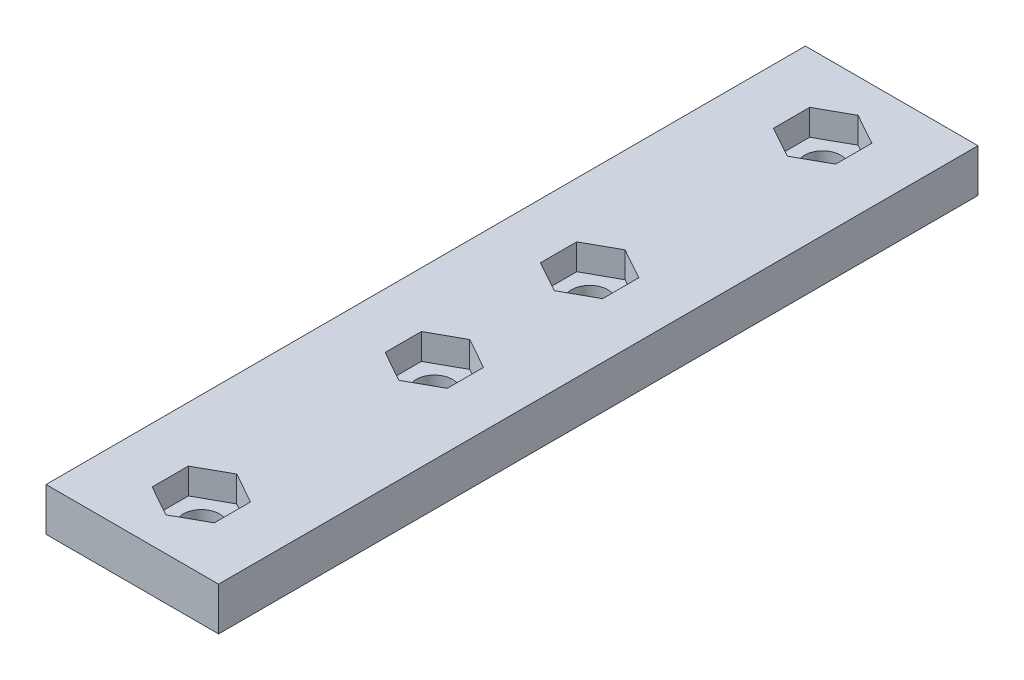
ISO-10303-21;
HEADER;
FILE_DESCRIPTION(('STEP AP214'),'2;1');
FILE_NAME('part.step','',(''),(''),'','','');
FILE_SCHEMA(('AUTOMOTIVE_DESIGN { 1 0 10303 214 1 1 1 1 }'));
ENDSEC;
DATA;
#1=APPLICATION_CONTEXT('core data for automotive mechanical design processes');
#2=APPLICATION_PROTOCOL_DEFINITION('international standard','automotive_design',2000,#1);
#3=PRODUCT_CONTEXT('',#1,'mechanical');
#4=PRODUCT('Part','Part','',(#3));
#5=PRODUCT_RELATED_PRODUCT_CATEGORY('part','',(#4));
#6=PRODUCT_DEFINITION_FORMATION('','',#4);
#7=PRODUCT_DEFINITION_CONTEXT('part definition',#1,'design');
#8=PRODUCT_DEFINITION('design','',#6,#7);
#9=PRODUCT_DEFINITION_SHAPE('','',#8);
#10=(LENGTH_UNIT() NAMED_UNIT(*) SI_UNIT(.MILLI.,.METRE.));
#11=(NAMED_UNIT(*) PLANE_ANGLE_UNIT() SI_UNIT($,.RADIAN.));
#12=(NAMED_UNIT(*) SI_UNIT($,.STERADIAN.) SOLID_ANGLE_UNIT());
#13=UNCERTAINTY_MEASURE_WITH_UNIT(LENGTH_MEASURE(1.E-05),#10,'distance_accuracy_value','');
#14=(GEOMETRIC_REPRESENTATION_CONTEXT(3) GLOBAL_UNCERTAINTY_ASSIGNED_CONTEXT((#13)) GLOBAL_UNIT_ASSIGNED_CONTEXT((#10,
#11,#12)) REPRESENTATION_CONTEXT('',''));
#15=CARTESIAN_POINT('',(0.,0.,0.));
#16=DIRECTION('',(0.,0.,1.));
#17=DIRECTION('',(1.,0.,0.));
#18=AXIS2_PLACEMENT_3D('',#15,#16,#17);
#19=CARTESIAN_POINT('',(0.,5.,31.5));
#20=DIRECTION('',(0.,-1.,0.));
#21=DIRECTION('',(0.,0.,-1.));
#22=AXIS2_PLACEMENT_3D('',#19,#20,#21);
#23=CYLINDRICAL_SURFACE('',#22,2.1);
#24=CARTESIAN_POINT('',(0.,0.,31.5));
#25=DIRECTION('',(0.,1.,0.));
#26=DIRECTION('',(0.,0.,1.));
#27=AXIS2_PLACEMENT_3D('',#24,#25,#26);
#28=CIRCLE('',#27,2.1);
#29=CARTESIAN_POINT('',(0.,0.,33.6));
#30=VERTEX_POINT('',#29);
#31=EDGE_CURVE('E544',#30,#30,#28,.F.);
#32=ORIENTED_EDGE('',*,*,#31,.T.);
#33=EDGE_LOOP('',(#32));
#34=FACE_BOUND('',#33,.T.);
#35=CARTESIAN_POINT('',(0.,2.,31.5));
#36=DIRECTION('',(0.,1.,0.));
#37=DIRECTION('',(0.,0.,1.));
#38=AXIS2_PLACEMENT_3D('',#35,#36,#37);
#39=CIRCLE('',#38,2.1);
#40=CARTESIAN_POINT('',(0.,2.,33.6));
#41=VERTEX_POINT('',#40);
#42=EDGE_CURVE('E391',#41,#41,#39,.F.);
#43=ORIENTED_EDGE('',*,*,#42,.F.);
#44=EDGE_LOOP('',(#43));
#45=FACE_BOUND('',#44,.T.);
#46=ADVANCED_FACE('F41',(#34,#45),#23,.F.);
#47=CARTESIAN_POINT('',(0.,5.,-13.5));
#48=DIRECTION('',(0.,-1.,0.));
#49=DIRECTION('',(0.,0.,-1.));
#50=AXIS2_PLACEMENT_3D('',#47,#48,#49);
#51=CYLINDRICAL_SURFACE('',#50,2.1);
#52=CARTESIAN_POINT('',(0.,0.,-13.5));
#53=DIRECTION('',(0.,1.,0.));
#54=DIRECTION('',(0.,0.,1.));
#55=AXIS2_PLACEMENT_3D('',#52,#53,#54);
#56=CIRCLE('',#55,2.1);
#57=CARTESIAN_POINT('',(0.,0.,-11.4));
#58=VERTEX_POINT('',#57);
#59=EDGE_CURVE('E524',#58,#58,#56,.T.);
#60=ORIENTED_EDGE('',*,*,#59,.F.);
#61=EDGE_LOOP('',(#60));
#62=FACE_BOUND('',#61,.T.);
#63=CARTESIAN_POINT('',(0.,2.,-13.5));
#64=DIRECTION('',(0.,1.,0.));
#65=DIRECTION('',(0.,0.,1.));
#66=AXIS2_PLACEMENT_3D('',#63,#64,#65);
#67=CIRCLE('',#66,2.1);
#68=CARTESIAN_POINT('',(0.,2.,-11.4));
#69=VERTEX_POINT('',#68);
#70=EDGE_CURVE('E234',#69,#69,#67,.F.);
#71=ORIENTED_EDGE('',*,*,#70,.F.);
#72=EDGE_LOOP('',(#71));
#73=FACE_BOUND('',#72,.T.);
#74=ADVANCED_FACE('F621',(#62,#73),#51,.F.);
#75=CARTESIAN_POINT('',(0.,5.,13.5));
#76=DIRECTION('',(0.,-1.,0.));
#77=DIRECTION('',(0.,0.,-1.));
#78=AXIS2_PLACEMENT_3D('',#75,#76,#77);
#79=CYLINDRICAL_SURFACE('',#78,2.1);
#80=CARTESIAN_POINT('',(0.,0.,13.5));
#81=DIRECTION('',(0.,1.,0.));
#82=DIRECTION('',(0.,0.,1.));
#83=AXIS2_PLACEMENT_3D('',#80,#81,#82);
#84=CIRCLE('',#83,2.1);
#85=CARTESIAN_POINT('',(0.,0.,15.6));
#86=VERTEX_POINT('',#85);
#87=EDGE_CURVE('E292',#86,#86,#84,.T.);
#88=ORIENTED_EDGE('',*,*,#87,.F.);
#89=EDGE_LOOP('',(#88));
#90=FACE_BOUND('',#89,.T.);
#91=CARTESIAN_POINT('',(0.,2.,13.5));
#92=DIRECTION('',(0.,1.,0.));
#93=DIRECTION('',(0.,0.,1.));
#94=AXIS2_PLACEMENT_3D('',#91,#92,#93);
#95=CIRCLE('',#94,2.1);
#96=CARTESIAN_POINT('',(0.,2.,15.6));
#97=VERTEX_POINT('',#96);
#98=EDGE_CURVE('E326',#97,#97,#95,.F.);
#99=ORIENTED_EDGE('',*,*,#98,.F.);
#100=EDGE_LOOP('',(#99));
#101=FACE_BOUND('',#100,.T.);
#102=ADVANCED_FACE('F43',(#90,#101),#79,.F.);
#103=CARTESIAN_POINT('',(0.,5.,58.5));
#104=DIRECTION('',(0.,-1.,0.));
#105=DIRECTION('',(0.,0.,-1.));
#106=AXIS2_PLACEMENT_3D('',#103,#104,#105);
#107=CYLINDRICAL_SURFACE('',#106,2.1);
#108=CARTESIAN_POINT('',(0.,0.,58.5));
#109=DIRECTION('',(0.,1.,0.));
#110=DIRECTION('',(0.,0.,1.));
#111=AXIS2_PLACEMENT_3D('',#108,#109,#110);
#112=CIRCLE('',#111,2.1);
#113=CARTESIAN_POINT('',(0.,0.,60.6));
#114=VERTEX_POINT('',#113);
#115=EDGE_CURVE('E509',#114,#114,#112,.F.);
#116=ORIENTED_EDGE('',*,*,#115,.T.);
#117=EDGE_LOOP('',(#116));
#118=FACE_BOUND('',#117,.T.);
#119=CARTESIAN_POINT('',(0.,2.,58.5));
#120=DIRECTION('',(0.,1.,0.));
#121=DIRECTION('',(0.,0.,1.));
#122=AXIS2_PLACEMENT_3D('',#119,#120,#121);
#123=CIRCLE('',#122,2.1);
#124=CARTESIAN_POINT('',(0.,2.,60.6));
#125=VERTEX_POINT('',#124);
#126=EDGE_CURVE('E459',#125,#125,#123,.F.);
#127=ORIENTED_EDGE('',*,*,#126,.F.);
#128=EDGE_LOOP('',(#127));
#129=FACE_BOUND('',#128,.T.);
#130=ADVANCED_FACE('F580',(#118,#129),#107,.F.);
#131=CARTESIAN_POINT('',(0.,5.,0.));
#132=DIRECTION('',(0.,1.,0.));
#133=DIRECTION('',(0.,0.,1.));
#134=AXIS2_PLACEMENT_3D('',#131,#132,#133);
#135=PLANE('',#134);
#136=DIRECTION('',(0.874157276121538,0.,-0.485642931178632));
#137=VECTOR('',#136,1.);
#138=CARTESIAN_POINT('',(-3.99056603773585,5.,-7.18301886792454));
#139=LINE('',#138,#137);
#140=CARTESIAN_POINT('',(0.,5.,-9.4));
#141=VERTEX_POINT('',#140);
#142=CARTESIAN_POINT('',(3.6,5.,-11.4));
#143=VERTEX_POINT('',#142);
#144=EDGE_CURVE('E57',#141,#143,#139,.T.);
#145=ORIENTED_EDGE('',*,*,#144,.F.);
#146=DIRECTION('',(-0.874157276121538,0.,-0.485642931178632));
#147=VECTOR('',#146,1.);
#148=CARTESIAN_POINT('',(3.99056603773585,5.,-7.18301886792453));
#149=LINE('',#148,#147);
#150=CARTESIAN_POINT('',(-3.6,5.,-11.4));
#151=VERTEX_POINT('',#150);
#152=EDGE_CURVE('E251',#141,#151,#149,.T.);
#153=ORIENTED_EDGE('',*,*,#152,.T.);
#154=DIRECTION('',(0.,0.,-1.));
#155=VECTOR('',#154,1.);
#156=CARTESIAN_POINT('',(-3.6,5.,0.));
#157=LINE('',#156,#155);
#158=CARTESIAN_POINT('',(-3.6,5.,-15.6));
#159=VERTEX_POINT('',#158);
#160=EDGE_CURVE('E255',#151,#159,#157,.T.);
#161=ORIENTED_EDGE('',*,*,#160,.T.);
#162=DIRECTION('',(-0.874157276121538,0.,0.485642931178632));
#163=VECTOR('',#162,1.);
#164=CARTESIAN_POINT('',(-7.47169811320755,5.,-13.4490566037736));
#165=LINE('',#164,#163);
#166=CARTESIAN_POINT('',(0.,5.,-17.6));
#167=VERTEX_POINT('',#166);
#168=EDGE_CURVE('E282',#167,#159,#165,.T.);
#169=ORIENTED_EDGE('',*,*,#168,.F.);
#170=DIRECTION('',(0.874157276121538,0.,0.485642931178632));
#171=VECTOR('',#170,1.);
#172=CARTESIAN_POINT('',(7.47169811320755,5.,-13.4490566037736));
#173=LINE('',#172,#171);
#174=CARTESIAN_POINT('',(3.6,5.,-15.6));
#175=VERTEX_POINT('',#174);
#176=EDGE_CURVE('E278',#167,#175,#173,.T.);
#177=ORIENTED_EDGE('',*,*,#176,.T.);
#178=DIRECTION('',(0.,0.,-1.));
#179=VECTOR('',#178,1.);
#180=CARTESIAN_POINT('',(3.6,5.,0.));
#181=LINE('',#180,#179);
#182=EDGE_CURVE('E274',#143,#175,#181,.T.);
#183=ORIENTED_EDGE('',*,*,#182,.F.);
#184=EDGE_LOOP('',(#145,#153,#161,#169,#177,#183));
#185=FACE_BOUND('',#184,.T.);
#186=DIRECTION('',(0.874157276121538,0.,-0.485642931178631));
#187=VECTOR('',#186,1.);
#188=CARTESIAN_POINT('',(7.47169811320754,5.,13.4490566037736));
#189=LINE('',#188,#187);
#190=CARTESIAN_POINT('',(0.,5.,17.6));
#191=VERTEX_POINT('',#190);
#192=CARTESIAN_POINT('',(3.6,5.,15.6));
#193=VERTEX_POINT('',#192);
#194=EDGE_CURVE('E65',#191,#193,#189,.T.);
#195=ORIENTED_EDGE('',*,*,#194,.F.);
#196=DIRECTION('',(-0.874157276121538,0.,-0.485642931178632));
#197=VECTOR('',#196,1.);
#198=CARTESIAN_POINT('',(-7.47169811320755,5.,13.4490566037736));
#199=LINE('',#198,#197);
#200=CARTESIAN_POINT('',(-3.6,5.,15.6));
#201=VERTEX_POINT('',#200);
#202=EDGE_CURVE('E309',#191,#201,#199,.T.);
#203=ORIENTED_EDGE('',*,*,#202,.T.);
#204=DIRECTION('',(0.,0.,-1.));
#205=VECTOR('',#204,1.);
#206=CARTESIAN_POINT('',(-3.6,5.,0.));
#207=LINE('',#206,#205);
#208=CARTESIAN_POINT('',(-3.6,5.,11.4));
#209=VERTEX_POINT('',#208);
#210=EDGE_CURVE('E346',#201,#209,#207,.T.);
#211=ORIENTED_EDGE('',*,*,#210,.T.);
#212=DIRECTION('',(-0.874157276121538,0.,0.485642931178632));
#213=VECTOR('',#212,1.);
#214=CARTESIAN_POINT('',(3.99056603773585,5.,7.18301886792453));
#215=LINE('',#214,#213);
#216=CARTESIAN_POINT('',(0.,5.,9.4));
#217=VERTEX_POINT('',#216);
#218=EDGE_CURVE('E342',#217,#209,#215,.T.);
#219=ORIENTED_EDGE('',*,*,#218,.F.);
#220=DIRECTION('',(0.874157276121538,0.,0.485642931178631));
#221=VECTOR('',#220,1.);
#222=CARTESIAN_POINT('',(-3.99056603773584,5.,7.18301886792454));
#223=LINE('',#222,#221);
#224=CARTESIAN_POINT('',(3.6,5.,11.4));
#225=VERTEX_POINT('',#224);
#226=EDGE_CURVE('E338',#217,#225,#223,.T.);
#227=ORIENTED_EDGE('',*,*,#226,.T.);
#228=DIRECTION('',(0.,0.,-1.));
#229=VECTOR('',#228,1.);
#230=CARTESIAN_POINT('',(3.6,5.,0.));
#231=LINE('',#230,#229);
#232=EDGE_CURVE('E333',#193,#225,#231,.T.);
#233=ORIENTED_EDGE('',*,*,#232,.F.);
#234=EDGE_LOOP('',(#195,#203,#211,#219,#227,#233));
#235=FACE_BOUND('',#234,.T.);
#236=DIRECTION('',(0.874157276121538,0.,-0.485642931178632));
#237=VECTOR('',#236,1.);
#238=CARTESIAN_POINT('',(26.5754716981132,5.,47.8358490566038));
#239=LINE('',#238,#237);
#240=CARTESIAN_POINT('',(0.,5.,62.6));
#241=VERTEX_POINT('',#240);
#242=CARTESIAN_POINT('',(3.6,5.,60.6));
#243=VERTEX_POINT('',#242);
#244=EDGE_CURVE('E468',#241,#243,#239,.T.);
#245=ORIENTED_EDGE('',*,*,#244,.F.);
#246=DIRECTION('',(-0.874157276121537,0.,-0.485642931178633));
#247=VECTOR('',#246,1.);
#248=CARTESIAN_POINT('',(-26.5754716981132,5.,47.8358490566037));
#249=LINE('',#248,#247);
#250=CARTESIAN_POINT('',(-3.6,5.,60.6));
#251=VERTEX_POINT('',#250);
#252=EDGE_CURVE('E464',#241,#251,#249,.T.);
#253=ORIENTED_EDGE('',*,*,#252,.T.);
#254=DIRECTION('',(0.,0.,1.));
#255=VECTOR('',#254,1.);
#256=CARTESIAN_POINT('',(-3.6,5.,0.));
#257=LINE('',#256,#255);
#258=CARTESIAN_POINT('',(-3.6,5.,56.4));
#259=VERTEX_POINT('',#258);
#260=EDGE_CURVE('E441',#259,#251,#257,.T.);
#261=ORIENTED_EDGE('',*,*,#260,.F.);
#262=DIRECTION('',(-0.874157276121539,0.,0.48564293117863));
#263=VECTOR('',#262,1.);
#264=CARTESIAN_POINT('',(23.0943396226414,5.,41.5698113207548));
#265=LINE('',#264,#263);
#266=CARTESIAN_POINT('',(0.,5.,54.4));
#267=VERTEX_POINT('',#266);
#268=EDGE_CURVE('E480',#267,#259,#265,.T.);
#269=ORIENTED_EDGE('',*,*,#268,.F.);
#270=DIRECTION('',(0.874157276121539,0.,0.48564293117863));
#271=VECTOR('',#270,1.);
#272=CARTESIAN_POINT('',(-23.0943396226414,5.,41.5698113207549));
#273=LINE('',#272,#271);
#274=CARTESIAN_POINT('',(3.6,5.,56.4));
#275=VERTEX_POINT('',#274);
#276=EDGE_CURVE('E476',#267,#275,#273,.T.);
#277=ORIENTED_EDGE('',*,*,#276,.T.);
#278=DIRECTION('',(0.,0.,1.));
#279=VECTOR('',#278,1.);
#280=CARTESIAN_POINT('',(3.6,5.,0.));
#281=LINE('',#280,#279);
#282=EDGE_CURVE('E472',#275,#243,#281,.T.);
#283=ORIENTED_EDGE('',*,*,#282,.T.);
#284=EDGE_LOOP('',(#245,#253,#261,#269,#277,#283));
#285=FACE_BOUND('',#284,.T.);
#286=DIRECTION('',(1.,0.,0.));
#287=VECTOR('',#286,1.);
#288=CARTESIAN_POINT('',(0.,5.,-21.5));
#289=LINE('',#288,#287);
#290=CARTESIAN_POINT('',(-10.,5.,-21.5));
#291=VERTEX_POINT('',#290);
#292=CARTESIAN_POINT('',(10.,5.,-21.5));
#293=VERTEX_POINT('',#292);
#294=EDGE_CURVE('E504',#291,#293,#289,.T.);
#295=ORIENTED_EDGE('',*,*,#294,.F.);
#296=DIRECTION('',(0.,0.,-1.));
#297=VECTOR('',#296,1.);
#298=CARTESIAN_POINT('',(-10.,5.,0.));
#299=LINE('',#298,#297);
#300=CARTESIAN_POINT('',(-10.,5.,66.5));
#301=VERTEX_POINT('',#300);
#302=EDGE_CURVE('E508',#301,#291,#299,.T.);
#303=ORIENTED_EDGE('',*,*,#302,.F.);
#304=DIRECTION('',(1.,0.,0.));
#305=VECTOR('',#304,1.);
#306=CARTESIAN_POINT('',(0.,5.,66.5));
#307=LINE('',#306,#305);
#308=CARTESIAN_POINT('',(10.,5.,66.5));
#309=VERTEX_POINT('',#308);
#310=EDGE_CURVE('E513',#301,#309,#307,.T.);
#311=ORIENTED_EDGE('',*,*,#310,.T.);
#312=DIRECTION('',(0.,0.,-1.));
#313=VECTOR('',#312,1.);
#314=CARTESIAN_POINT('',(10.,5.,0.));
#315=LINE('',#314,#313);
#316=EDGE_CURVE('E517',#309,#293,#315,.T.);
#317=ORIENTED_EDGE('',*,*,#316,.T.);
#318=EDGE_LOOP('',(#295,#303,#311,#317));
#319=FACE_BOUND('',#318,.T.);
#320=DIRECTION('',(0.874157276121538,0.,-0.485642931178632));
#321=VECTOR('',#320,1.);
#322=CARTESIAN_POINT('',(15.1132075471698,5.,27.2037735849057));
#323=LINE('',#322,#321);
#324=CARTESIAN_POINT('',(0.,5.,35.6));
#325=VERTEX_POINT('',#324);
#326=CARTESIAN_POINT('',(3.6,5.,33.6));
#327=VERTEX_POINT('',#326);
#328=EDGE_CURVE('E400',#325,#327,#323,.T.);
#329=ORIENTED_EDGE('',*,*,#328,.F.);
#330=DIRECTION('',(-0.874157276121537,0.,-0.485642931178633));
#331=VECTOR('',#330,1.);
#332=CARTESIAN_POINT('',(-15.1132075471698,5.,27.2037735849056));
#333=LINE('',#332,#331);
#334=CARTESIAN_POINT('',(-3.6,5.,33.6));
#335=VERTEX_POINT('',#334);
#336=EDGE_CURVE('E396',#325,#335,#333,.T.);
#337=ORIENTED_EDGE('',*,*,#336,.T.);
#338=DIRECTION('',(0.,0.,1.));
#339=VECTOR('',#338,1.);
#340=CARTESIAN_POINT('',(-3.6,5.,0.));
#341=LINE('',#340,#339);
#342=CARTESIAN_POINT('',(-3.6,5.,29.4));
#343=VERTEX_POINT('',#342);
#344=EDGE_CURVE('E373',#343,#335,#341,.T.);
#345=ORIENTED_EDGE('',*,*,#344,.F.);
#346=DIRECTION('',(-0.874157276121538,0.,0.485642931178632));
#347=VECTOR('',#346,1.);
#348=CARTESIAN_POINT('',(11.6320754716981,5.,20.9377358490566));
#349=LINE('',#348,#347);
#350=CARTESIAN_POINT('',(0.,5.,27.4));
#351=VERTEX_POINT('',#350);
#352=EDGE_CURVE('E413',#351,#343,#349,.T.);
#353=ORIENTED_EDGE('',*,*,#352,.F.);
#354=DIRECTION('',(0.874157276121538,0.,0.485642931178631));
#355=VECTOR('',#354,1.);
#356=CARTESIAN_POINT('',(-11.6320754716981,5.,20.9377358490566));
#357=LINE('',#356,#355);
#358=CARTESIAN_POINT('',(3.60000000000001,5.,29.4));
#359=VERTEX_POINT('',#358);
#360=EDGE_CURVE('E409',#351,#359,#357,.T.);
#361=ORIENTED_EDGE('',*,*,#360,.T.);
#362=DIRECTION('',(0.,0.,1.));
#363=VECTOR('',#362,1.);
#364=CARTESIAN_POINT('',(3.6,5.,0.));
#365=LINE('',#364,#363);
#366=EDGE_CURVE('E405',#359,#327,#365,.T.);
#367=ORIENTED_EDGE('',*,*,#366,.T.);
#368=EDGE_LOOP('',(#329,#337,#345,#353,#361,#367));
#369=FACE_BOUND('',#368,.T.);
#370=ADVANCED_FACE('F577',(#185,#235,#285,#319,#369),#135,.T.);
#371=CARTESIAN_POINT('',(0.,5.,-21.5));
#372=DIRECTION('',(0.,0.,-1.));
#373=DIRECTION('',(-1.,0.,0.));
#374=AXIS2_PLACEMENT_3D('',#371,#372,#373);
#375=PLANE('',#374);
#376=DIRECTION('',(1.,0.,0.));
#377=VECTOR('',#376,1.);
#378=CARTESIAN_POINT('',(0.,0.,-21.5));
#379=LINE('',#378,#377);
#380=CARTESIAN_POINT('',(-10.,0.,-21.5));
#381=VERTEX_POINT('',#380);
#382=CARTESIAN_POINT('',(10.,0.,-21.5));
#383=VERTEX_POINT('',#382);
#384=EDGE_CURVE('E528',#381,#383,#379,.T.);
#385=ORIENTED_EDGE('',*,*,#384,.F.);
#386=DIRECTION('',(0.,-1.,0.));
#387=VECTOR('',#386,1.);
#388=CARTESIAN_POINT('',(-10.,5.,-21.5));
#389=LINE('',#388,#387);
#390=EDGE_CURVE('E11',#291,#381,#389,.T.);
#391=ORIENTED_EDGE('',*,*,#390,.F.);
#392=ORIENTED_EDGE('',*,*,#294,.T.);
#393=DIRECTION('',(0.,-1.,0.));
#394=VECTOR('',#393,1.);
#395=CARTESIAN_POINT('',(10.,5.,-21.5));
#396=LINE('',#395,#394);
#397=EDGE_CURVE('E520',#293,#383,#396,.T.);
#398=ORIENTED_EDGE('',*,*,#397,.T.);
#399=EDGE_LOOP('',(#385,#391,#392,#398));
#400=FACE_BOUND('',#399,.T.);
#401=ADVANCED_FACE('F572',(#400),#375,.T.);
#402=CARTESIAN_POINT('',(-10.,5.,0.));
#403=DIRECTION('',(-1.,0.,0.));
#404=DIRECTION('',(0.,0.,1.));
#405=AXIS2_PLACEMENT_3D('',#402,#403,#404);
#406=PLANE('',#405);
#407=DIRECTION('',(0.,0.,-1.));
#408=VECTOR('',#407,1.);
#409=CARTESIAN_POINT('',(-10.,0.,0.));
#410=LINE('',#409,#408);
#411=CARTESIAN_POINT('',(-10.,0.,66.5));
#412=VERTEX_POINT('',#411);
#413=EDGE_CURVE('E532',#412,#381,#410,.T.);
#414=ORIENTED_EDGE('',*,*,#413,.F.);
#415=DIRECTION('',(0.,-1.,0.));
#416=VECTOR('',#415,1.);
#417=CARTESIAN_POINT('',(-10.,5.,66.5));
#418=LINE('',#417,#416);
#419=EDGE_CURVE('E50',#301,#412,#418,.T.);
#420=ORIENTED_EDGE('',*,*,#419,.F.);
#421=ORIENTED_EDGE('',*,*,#302,.T.);
#422=ORIENTED_EDGE('',*,*,#390,.T.);
#423=EDGE_LOOP('',(#414,#420,#421,#422));
#424=FACE_BOUND('',#423,.T.);
#425=ADVANCED_FACE('F568',(#424),#406,.T.);
#426=CARTESIAN_POINT('',(0.,5.,66.5));
#427=DIRECTION('',(0.,0.,-1.));
#428=DIRECTION('',(-1.,0.,0.));
#429=AXIS2_PLACEMENT_3D('',#426,#427,#428);
#430=PLANE('',#429);
#431=DIRECTION('',(1.,0.,0.));
#432=VECTOR('',#431,1.);
#433=CARTESIAN_POINT('',(0.,0.,66.5));
#434=LINE('',#433,#432);
#435=CARTESIAN_POINT('',(10.,0.,66.5));
#436=VERTEX_POINT('',#435);
#437=EDGE_CURVE('E536',#412,#436,#434,.T.);
#438=ORIENTED_EDGE('',*,*,#437,.T.);
#439=DIRECTION('',(0.,-1.,0.));
#440=VECTOR('',#439,1.);
#441=CARTESIAN_POINT('',(10.,5.,66.5));
#442=LINE('',#441,#440);
#443=EDGE_CURVE('E553',#309,#436,#442,.T.);
#444=ORIENTED_EDGE('',*,*,#443,.F.);
#445=ORIENTED_EDGE('',*,*,#310,.F.);
#446=ORIENTED_EDGE('',*,*,#419,.T.);
#447=EDGE_LOOP('',(#438,#444,#445,#446));
#448=FACE_BOUND('',#447,.T.);
#449=ADVANCED_FACE('F560',(#448),#430,.F.);
#450=CARTESIAN_POINT('',(10.,5.,0.));
#451=DIRECTION('',(-1.,0.,0.));
#452=DIRECTION('',(0.,0.,1.));
#453=AXIS2_PLACEMENT_3D('',#450,#451,#452);
#454=PLANE('',#453);
#455=DIRECTION('',(0.,0.,-1.));
#456=VECTOR('',#455,1.);
#457=CARTESIAN_POINT('',(10.,0.,0.));
#458=LINE('',#457,#456);
#459=EDGE_CURVE('E540',#436,#383,#458,.T.);
#460=ORIENTED_EDGE('',*,*,#459,.T.);
#461=ORIENTED_EDGE('',*,*,#397,.F.);
#462=ORIENTED_EDGE('',*,*,#316,.F.);
#463=ORIENTED_EDGE('',*,*,#443,.T.);
#464=EDGE_LOOP('',(#460,#461,#462,#463));
#465=FACE_BOUND('',#464,.T.);
#466=ADVANCED_FACE('F575',(#465),#454,.F.);
#467=CARTESIAN_POINT('',(0.,0.,0.));
#468=DIRECTION('',(0.,1.,0.));
#469=DIRECTION('',(0.,0.,1.));
#470=AXIS2_PLACEMENT_3D('',#467,#468,#469);
#471=PLANE('',#470);
#472=ORIENTED_EDGE('',*,*,#87,.T.);
#473=EDGE_LOOP('',(#472));
#474=FACE_BOUND('',#473,.T.);
#475=ORIENTED_EDGE('',*,*,#59,.T.);
#476=EDGE_LOOP('',(#475));
#477=FACE_BOUND('',#476,.T.);
#478=ORIENTED_EDGE('',*,*,#384,.T.);
#479=ORIENTED_EDGE('',*,*,#459,.F.);
#480=ORIENTED_EDGE('',*,*,#437,.F.);
#481=ORIENTED_EDGE('',*,*,#413,.T.);
#482=EDGE_LOOP('',(#478,#479,#480,#481));
#483=FACE_BOUND('',#482,.T.);
#484=ORIENTED_EDGE('',*,*,#31,.F.);
#485=EDGE_LOOP('',(#484));
#486=FACE_BOUND('',#485,.T.);
#487=ORIENTED_EDGE('',*,*,#115,.F.);
#488=EDGE_LOOP('',(#487));
#489=FACE_BOUND('',#488,.T.);
#490=ADVANCED_FACE('F566',(#474,#477,#483,#486,#489),#471,.F.);
#491=CARTESIAN_POINT('',(-26.5754716981132,2.,47.8358490566037));
#492=DIRECTION('',(0.485642931178633,0.,-0.874157276121537));
#493=DIRECTION('',(-0.874157276121537,0.,-0.485642931178633));
#494=AXIS2_PLACEMENT_3D('',#491,#492,#493);
#495=PLANE('',#494);
#496=ORIENTED_EDGE('',*,*,#252,.F.);
#497=DIRECTION('',(0.,1.,0.));
#498=VECTOR('',#497,1.);
#499=CARTESIAN_POINT('',(0.,2.,62.6));
#500=LINE('',#499,#498);
#501=CARTESIAN_POINT('',(0.,2.,62.6));
#502=VERTEX_POINT('',#501);
#503=EDGE_CURVE('E463',#502,#241,#500,.T.);
#504=ORIENTED_EDGE('',*,*,#503,.F.);
#505=DIRECTION('',(-0.874157276121537,0.,-0.485642931178633));
#506=VECTOR('',#505,1.);
#507=CARTESIAN_POINT('',(-26.5754716981132,2.,47.8358490566037));
#508=LINE('',#507,#506);
#509=CARTESIAN_POINT('',(-3.6,2.,60.6));
#510=VERTEX_POINT('',#509);
#511=EDGE_CURVE('E437',#502,#510,#508,.T.);
#512=ORIENTED_EDGE('',*,*,#511,.T.);
#513=DIRECTION('',(0.,1.,0.));
#514=VECTOR('',#513,1.);
#515=CARTESIAN_POINT('',(-3.6,2.,60.6));
#516=LINE('',#515,#514);
#517=EDGE_CURVE('E401',#510,#251,#516,.T.);
#518=ORIENTED_EDGE('',*,*,#517,.T.);
#519=EDGE_LOOP('',(#496,#504,#512,#518));
#520=FACE_BOUND('',#519,.T.);
#521=ADVANCED_FACE('F662',(#520),#495,.T.);
#522=CARTESIAN_POINT('',(-3.6,2.,0.));
#523=DIRECTION('',(-1.,0.,0.));
#524=DIRECTION('',(0.,0.,1.));
#525=AXIS2_PLACEMENT_3D('',#522,#523,#524);
#526=PLANE('',#525);
#527=ORIENTED_EDGE('',*,*,#260,.T.);
#528=ORIENTED_EDGE('',*,*,#517,.F.);
#529=DIRECTION('',(0.,0.,1.));
#530=VECTOR('',#529,1.);
#531=CARTESIAN_POINT('',(-3.6,2.,0.));
#532=LINE('',#531,#530);
#533=CARTESIAN_POINT('',(-3.6,2.,56.4));
#534=VERTEX_POINT('',#533);
#535=EDGE_CURVE('E455',#534,#510,#532,.T.);
#536=ORIENTED_EDGE('',*,*,#535,.F.);
#537=DIRECTION('',(0.,1.,0.));
#538=VECTOR('',#537,1.);
#539=CARTESIAN_POINT('',(-3.6,2.,56.4));
#540=LINE('',#539,#538);
#541=EDGE_CURVE('E489',#534,#259,#540,.T.);
#542=ORIENTED_EDGE('',*,*,#541,.T.);
#543=EDGE_LOOP('',(#527,#528,#536,#542));
#544=FACE_BOUND('',#543,.T.);
#545=ADVANCED_FACE('F669',(#544),#526,.F.);
#546=CARTESIAN_POINT('',(23.0943396226414,2.,41.5698113207548));
#547=DIRECTION('',(-0.48564293117863,0.,-0.874157276121539));
#548=DIRECTION('',(-0.874157276121539,0.,0.48564293117863));
#549=AXIS2_PLACEMENT_3D('',#546,#547,#548);
#550=PLANE('',#549);
#551=ORIENTED_EDGE('',*,*,#268,.T.);
#552=ORIENTED_EDGE('',*,*,#541,.F.);
#553=DIRECTION('',(-0.874157276121539,0.,0.48564293117863));
#554=VECTOR('',#553,1.);
#555=CARTESIAN_POINT('',(23.0943396226414,2.,41.5698113207548));
#556=LINE('',#555,#554);
#557=CARTESIAN_POINT('',(0.,2.,54.4));
#558=VERTEX_POINT('',#557);
#559=EDGE_CURVE('E451',#558,#534,#556,.T.);
#560=ORIENTED_EDGE('',*,*,#559,.F.);
#561=DIRECTION('',(0.,1.,0.));
#562=VECTOR('',#561,1.);
#563=CARTESIAN_POINT('',(0.,2.,54.4));
#564=LINE('',#563,#562);
#565=EDGE_CURVE('E492',#558,#267,#564,.T.);
#566=ORIENTED_EDGE('',*,*,#565,.T.);
#567=EDGE_LOOP('',(#551,#552,#560,#566));
#568=FACE_BOUND('',#567,.T.);
#569=ADVANCED_FACE('F677',(#568),#550,.F.);
#570=CARTESIAN_POINT('',(-23.0943396226414,2.,41.5698113207549));
#571=DIRECTION('',(-0.485642931178629,0.,0.874157276121539));
#572=DIRECTION('',(0.874157276121539,0.,0.48564293117863));
#573=AXIS2_PLACEMENT_3D('',#570,#571,#572);
#574=PLANE('',#573);
#575=ORIENTED_EDGE('',*,*,#276,.F.);
#576=ORIENTED_EDGE('',*,*,#565,.F.);
#577=DIRECTION('',(0.874157276121539,0.,0.48564293117863));
#578=VECTOR('',#577,1.);
#579=CARTESIAN_POINT('',(-23.0943396226414,2.,41.5698113207549));
#580=LINE('',#579,#578);
#581=CARTESIAN_POINT('',(3.6,2.,56.4));
#582=VERTEX_POINT('',#581);
#583=EDGE_CURVE('E448',#558,#582,#580,.T.);
#584=ORIENTED_EDGE('',*,*,#583,.T.);
#585=DIRECTION('',(0.,1.,0.));
#586=VECTOR('',#585,1.);
#587=CARTESIAN_POINT('',(3.6,2.,56.4));
#588=LINE('',#587,#586);
#589=EDGE_CURVE('E495',#582,#275,#588,.T.);
#590=ORIENTED_EDGE('',*,*,#589,.T.);
#591=EDGE_LOOP('',(#575,#576,#584,#590));
#592=FACE_BOUND('',#591,.T.);
#593=ADVANCED_FACE('F685',(#592),#574,.T.);
#594=CARTESIAN_POINT('',(3.6,2.,0.));
#595=DIRECTION('',(-1.,0.,0.));
#596=DIRECTION('',(0.,0.,1.));
#597=AXIS2_PLACEMENT_3D('',#594,#595,#596);
#598=PLANE('',#597);
#599=ORIENTED_EDGE('',*,*,#282,.F.);
#600=ORIENTED_EDGE('',*,*,#589,.F.);
#601=DIRECTION('',(0.,0.,1.));
#602=VECTOR('',#601,1.);
#603=CARTESIAN_POINT('',(3.6,2.,0.));
#604=LINE('',#603,#602);
#605=CARTESIAN_POINT('',(3.6,2.,60.6));
#606=VERTEX_POINT('',#605);
#607=EDGE_CURVE('E445',#582,#606,#604,.T.);
#608=ORIENTED_EDGE('',*,*,#607,.T.);
#609=DIRECTION('',(0.,1.,0.));
#610=VECTOR('',#609,1.);
#611=CARTESIAN_POINT('',(3.6,2.,60.6));
#612=LINE('',#611,#610);
#613=EDGE_CURVE('E498',#606,#243,#612,.T.);
#614=ORIENTED_EDGE('',*,*,#613,.T.);
#615=EDGE_LOOP('',(#599,#600,#608,#614));
#616=FACE_BOUND('',#615,.T.);
#617=ADVANCED_FACE('F693',(#616),#598,.T.);
#618=CARTESIAN_POINT('',(26.5754716981132,2.,47.8358490566038));
#619=DIRECTION('',(0.485642931178632,0.,0.874157276121538));
#620=DIRECTION('',(0.874157276121538,0.,-0.485642931178632));
#621=AXIS2_PLACEMENT_3D('',#618,#619,#620);
#622=PLANE('',#621);
#623=ORIENTED_EDGE('',*,*,#244,.T.);
#624=ORIENTED_EDGE('',*,*,#613,.F.);
#625=DIRECTION('',(0.874157276121538,0.,-0.485642931178632));
#626=VECTOR('',#625,1.);
#627=CARTESIAN_POINT('',(26.5754716981132,2.,47.8358490566038));
#628=LINE('',#627,#626);
#629=EDGE_CURVE('E440',#502,#606,#628,.T.);
#630=ORIENTED_EDGE('',*,*,#629,.F.);
#631=ORIENTED_EDGE('',*,*,#503,.T.);
#632=EDGE_LOOP('',(#623,#624,#630,#631));
#633=FACE_BOUND('',#632,.T.);
#634=ADVANCED_FACE('F701',(#633),#622,.F.);
#635=CARTESIAN_POINT('',(0.,2.,0.));
#636=DIRECTION('',(0.,1.,0.));
#637=DIRECTION('',(0.,0.,1.));
#638=AXIS2_PLACEMENT_3D('',#635,#636,#637);
#639=PLANE('',#638);
#640=ORIENTED_EDGE('',*,*,#511,.F.);
#641=ORIENTED_EDGE('',*,*,#629,.T.);
#642=ORIENTED_EDGE('',*,*,#607,.F.);
#643=ORIENTED_EDGE('',*,*,#583,.F.);
#644=ORIENTED_EDGE('',*,*,#559,.T.);
#645=ORIENTED_EDGE('',*,*,#535,.T.);
#646=EDGE_LOOP('',(#640,#641,#642,#643,#644,#645));
#647=FACE_BOUND('',#646,.T.);
#648=ORIENTED_EDGE('',*,*,#126,.T.);
#649=EDGE_LOOP('',(#648));
#650=FACE_BOUND('',#649,.T.);
#651=ADVANCED_FACE('F709',(#647,#650),#639,.T.);
#652=CARTESIAN_POINT('',(-15.1132075471698,2.,27.2037735849056));
#653=DIRECTION('',(0.485642931178633,0.,-0.874157276121537));
#654=DIRECTION('',(-0.874157276121537,0.,-0.485642931178633));
#655=AXIS2_PLACEMENT_3D('',#652,#653,#654);
#656=PLANE('',#655);
#657=ORIENTED_EDGE('',*,*,#336,.F.);
#658=DIRECTION('',(0.,1.,0.));
#659=VECTOR('',#658,1.);
#660=CARTESIAN_POINT('',(0.,2.,35.6));
#661=LINE('',#660,#659);
#662=CARTESIAN_POINT('',(0.,2.,35.6));
#663=VERTEX_POINT('',#662);
#664=EDGE_CURVE('E395',#663,#325,#661,.T.);
#665=ORIENTED_EDGE('',*,*,#664,.F.);
#666=DIRECTION('',(-0.874157276121537,0.,-0.485642931178633));
#667=VECTOR('',#666,1.);
#668=CARTESIAN_POINT('',(-15.1132075471698,2.,27.2037735849056));
#669=LINE('',#668,#667);
#670=CARTESIAN_POINT('',(-3.6,2.,33.6));
#671=VERTEX_POINT('',#670);
#672=EDGE_CURVE('E369',#663,#671,#669,.T.);
#673=ORIENTED_EDGE('',*,*,#672,.T.);
#674=DIRECTION('',(0.,1.,0.));
#675=VECTOR('',#674,1.);
#676=CARTESIAN_POINT('',(-3.6,2.,33.6));
#677=LINE('',#676,#675);
#678=EDGE_CURVE('E334',#671,#335,#677,.T.);
#679=ORIENTED_EDGE('',*,*,#678,.T.);
#680=EDGE_LOOP('',(#657,#665,#673,#679));
#681=FACE_BOUND('',#680,.T.);
#682=ADVANCED_FACE('F592',(#681),#656,.T.);
#683=CARTESIAN_POINT('',(-3.6,2.,0.));
#684=DIRECTION('',(-1.,0.,0.));
#685=DIRECTION('',(0.,0.,1.));
#686=AXIS2_PLACEMENT_3D('',#683,#684,#685);
#687=PLANE('',#686);
#688=ORIENTED_EDGE('',*,*,#344,.T.);
#689=ORIENTED_EDGE('',*,*,#678,.F.);
#690=DIRECTION('',(0.,0.,1.));
#691=VECTOR('',#690,1.);
#692=CARTESIAN_POINT('',(-3.6,2.,0.));
#693=LINE('',#692,#691);
#694=CARTESIAN_POINT('',(-3.6,2.,29.4));
#695=VERTEX_POINT('',#694);
#696=EDGE_CURVE('E387',#695,#671,#693,.T.);
#697=ORIENTED_EDGE('',*,*,#696,.F.);
#698=DIRECTION('',(0.,1.,0.));
#699=VECTOR('',#698,1.);
#700=CARTESIAN_POINT('',(-3.6,2.,29.4));
#701=LINE('',#700,#699);
#702=EDGE_CURVE('E422',#695,#343,#701,.T.);
#703=ORIENTED_EDGE('',*,*,#702,.T.);
#704=EDGE_LOOP('',(#688,#689,#697,#703));
#705=FACE_BOUND('',#704,.T.);
#706=ADVANCED_FACE('F602',(#705),#687,.F.);
#707=CARTESIAN_POINT('',(11.6320754716981,2.,20.9377358490566));
#708=DIRECTION('',(-0.485642931178632,0.,-0.874157276121538));
#709=DIRECTION('',(-0.874157276121538,0.,0.485642931178632));
#710=AXIS2_PLACEMENT_3D('',#707,#708,#709);
#711=PLANE('',#710);
#712=ORIENTED_EDGE('',*,*,#352,.T.);
#713=ORIENTED_EDGE('',*,*,#702,.F.);
#714=DIRECTION('',(-0.874157276121538,0.,0.485642931178632));
#715=VECTOR('',#714,1.);
#716=CARTESIAN_POINT('',(11.6320754716981,2.,20.9377358490566));
#717=LINE('',#716,#715);
#718=CARTESIAN_POINT('',(0.,2.,27.4));
#719=VERTEX_POINT('',#718);
#720=EDGE_CURVE('E383',#719,#695,#717,.T.);
#721=ORIENTED_EDGE('',*,*,#720,.F.);
#722=DIRECTION('',(0.,1.,0.));
#723=VECTOR('',#722,1.);
#724=CARTESIAN_POINT('',(0.,2.,27.4));
#725=LINE('',#724,#723);
#726=EDGE_CURVE('E425',#719,#351,#725,.T.);
#727=ORIENTED_EDGE('',*,*,#726,.T.);
#728=EDGE_LOOP('',(#712,#713,#721,#727));
#729=FACE_BOUND('',#728,.T.);
#730=ADVANCED_FACE('F606',(#729),#711,.F.);
#731=CARTESIAN_POINT('',(-11.6320754716981,2.,20.9377358490566));
#732=DIRECTION('',(-0.485642931178631,0.,0.874157276121538));
#733=DIRECTION('',(0.874157276121538,0.,0.485642931178631));
#734=AXIS2_PLACEMENT_3D('',#731,#732,#733);
#735=PLANE('',#734);
#736=ORIENTED_EDGE('',*,*,#360,.F.);
#737=ORIENTED_EDGE('',*,*,#726,.F.);
#738=DIRECTION('',(0.874157276121538,0.,0.485642931178631));
#739=VECTOR('',#738,1.);
#740=CARTESIAN_POINT('',(-11.6320754716981,2.,20.9377358490566));
#741=LINE('',#740,#739);
#742=CARTESIAN_POINT('',(3.60000000000001,2.,29.4));
#743=VERTEX_POINT('',#742);
#744=EDGE_CURVE('E380',#719,#743,#741,.T.);
#745=ORIENTED_EDGE('',*,*,#744,.T.);
#746=DIRECTION('',(0.,1.,0.));
#747=VECTOR('',#746,1.);
#748=CARTESIAN_POINT('',(3.60000000000001,2.,29.4));
#749=LINE('',#748,#747);
#750=EDGE_CURVE('E428',#743,#359,#749,.T.);
#751=ORIENTED_EDGE('',*,*,#750,.T.);
#752=EDGE_LOOP('',(#736,#737,#745,#751));
#753=FACE_BOUND('',#752,.T.);
#754=ADVANCED_FACE('F608',(#753),#735,.T.);
#755=CARTESIAN_POINT('',(3.6,2.,0.));
#756=DIRECTION('',(-1.,0.,0.));
#757=DIRECTION('',(0.,0.,1.));
#758=AXIS2_PLACEMENT_3D('',#755,#756,#757);
#759=PLANE('',#758);
#760=ORIENTED_EDGE('',*,*,#366,.F.);
#761=ORIENTED_EDGE('',*,*,#750,.F.);
#762=DIRECTION('',(0.,0.,1.));
#763=VECTOR('',#762,1.);
#764=CARTESIAN_POINT('',(3.6,2.,0.));
#765=LINE('',#764,#763);
#766=CARTESIAN_POINT('',(3.6,2.,33.6));
#767=VERTEX_POINT('',#766);
#768=EDGE_CURVE('E377',#743,#767,#765,.T.);
#769=ORIENTED_EDGE('',*,*,#768,.T.);
#770=DIRECTION('',(0.,1.,0.));
#771=VECTOR('',#770,1.);
#772=CARTESIAN_POINT('',(3.6,2.,33.6));
#773=LINE('',#772,#771);
#774=EDGE_CURVE('E431',#767,#327,#773,.T.);
#775=ORIENTED_EDGE('',*,*,#774,.T.);
#776=EDGE_LOOP('',(#760,#761,#769,#775));
#777=FACE_BOUND('',#776,.T.);
#778=ADVANCED_FACE('F611',(#777),#759,.T.);
#779=CARTESIAN_POINT('',(15.1132075471698,2.,27.2037735849057));
#780=DIRECTION('',(0.485642931178632,0.,0.874157276121538));
#781=DIRECTION('',(0.874157276121538,0.,-0.485642931178632));
#782=AXIS2_PLACEMENT_3D('',#779,#780,#781);
#783=PLANE('',#782);
#784=ORIENTED_EDGE('',*,*,#328,.T.);
#785=ORIENTED_EDGE('',*,*,#774,.F.);
#786=DIRECTION('',(0.874157276121538,0.,-0.485642931178632));
#787=VECTOR('',#786,1.);
#788=CARTESIAN_POINT('',(15.1132075471698,2.,27.2037735849057));
#789=LINE('',#788,#787);
#790=EDGE_CURVE('E372',#663,#767,#789,.T.);
#791=ORIENTED_EDGE('',*,*,#790,.F.);
#792=ORIENTED_EDGE('',*,*,#664,.T.);
#793=EDGE_LOOP('',(#784,#785,#791,#792));
#794=FACE_BOUND('',#793,.T.);
#795=ADVANCED_FACE('F588',(#794),#783,.F.);
#796=CARTESIAN_POINT('',(0.,2.,0.));
#797=DIRECTION('',(0.,1.,0.));
#798=DIRECTION('',(0.,0.,1.));
#799=AXIS2_PLACEMENT_3D('',#796,#797,#798);
#800=PLANE('',#799);
#801=ORIENTED_EDGE('',*,*,#672,.F.);
#802=ORIENTED_EDGE('',*,*,#790,.T.);
#803=ORIENTED_EDGE('',*,*,#768,.F.);
#804=ORIENTED_EDGE('',*,*,#744,.F.);
#805=ORIENTED_EDGE('',*,*,#720,.T.);
#806=ORIENTED_EDGE('',*,*,#696,.T.);
#807=EDGE_LOOP('',(#801,#802,#803,#804,#805,#806));
#808=FACE_BOUND('',#807,.T.);
#809=ORIENTED_EDGE('',*,*,#42,.T.);
#810=EDGE_LOOP('',(#809));
#811=FACE_BOUND('',#810,.T.);
#812=ADVANCED_FACE('F595',(#808,#811),#800,.T.);
#813=CARTESIAN_POINT('',(7.47169811320754,2.,13.4490566037736));
#814=DIRECTION('',(0.485642931178631,0.,0.874157276121538));
#815=DIRECTION('',(0.874157276121538,0.,-0.485642931178631));
#816=AXIS2_PLACEMENT_3D('',#813,#814,#815);
#817=PLANE('',#816);
#818=ORIENTED_EDGE('',*,*,#194,.T.);
#819=DIRECTION('',(0.,1.,0.));
#820=VECTOR('',#819,1.);
#821=CARTESIAN_POINT('',(3.6,2.,15.6));
#822=LINE('',#821,#820);
#823=CARTESIAN_POINT('',(3.6,2.,15.6));
#824=VERTEX_POINT('',#823);
#825=EDGE_CURVE('E330',#824,#193,#822,.T.);
#826=ORIENTED_EDGE('',*,*,#825,.F.);
#827=DIRECTION('',(0.874157276121538,0.,-0.485642931178631));
#828=VECTOR('',#827,1.);
#829=CARTESIAN_POINT('',(7.47169811320754,2.,13.4490566037736));
#830=LINE('',#829,#828);
#831=CARTESIAN_POINT('',(0.,2.,17.6));
#832=VERTEX_POINT('',#831);
#833=EDGE_CURVE('E304',#832,#824,#830,.T.);
#834=ORIENTED_EDGE('',*,*,#833,.F.);
#835=DIRECTION('',(0.,1.,0.));
#836=VECTOR('',#835,1.);
#837=CARTESIAN_POINT('',(0.,2.,17.6));
#838=LINE('',#837,#836);
#839=EDGE_CURVE('E275',#832,#191,#838,.T.);
#840=ORIENTED_EDGE('',*,*,#839,.T.);
#841=EDGE_LOOP('',(#818,#826,#834,#840));
#842=FACE_BOUND('',#841,.T.);
#843=ADVANCED_FACE('F759',(#842),#817,.F.);
#844=CARTESIAN_POINT('',(-7.47169811320755,2.,13.4490566037736));
#845=DIRECTION('',(0.485642931178632,0.,-0.874157276121538));
#846=DIRECTION('',(-0.874157276121538,0.,-0.485642931178632));
#847=AXIS2_PLACEMENT_3D('',#844,#845,#846);
#848=PLANE('',#847);
#849=ORIENTED_EDGE('',*,*,#202,.F.);
#850=ORIENTED_EDGE('',*,*,#839,.F.);
#851=DIRECTION('',(-0.874157276121538,0.,-0.485642931178632));
#852=VECTOR('',#851,1.);
#853=CARTESIAN_POINT('',(-7.47169811320755,2.,13.4490566037736));
#854=LINE('',#853,#852);
#855=CARTESIAN_POINT('',(-3.6,2.,15.6));
#856=VERTEX_POINT('',#855);
#857=EDGE_CURVE('E323',#832,#856,#854,.T.);
#858=ORIENTED_EDGE('',*,*,#857,.T.);
#859=DIRECTION('',(0.,1.,0.));
#860=VECTOR('',#859,1.);
#861=CARTESIAN_POINT('',(-3.6,2.,15.6));
#862=LINE('',#861,#860);
#863=EDGE_CURVE('E355',#856,#201,#862,.T.);
#864=ORIENTED_EDGE('',*,*,#863,.T.);
#865=EDGE_LOOP('',(#849,#850,#858,#864));
#866=FACE_BOUND('',#865,.T.);
#867=ADVANCED_FACE('F768',(#866),#848,.T.);
#868=CARTESIAN_POINT('',(-3.6,2.,0.));
#869=DIRECTION('',(1.,0.,0.));
#870=DIRECTION('',(0.,0.,-1.));
#871=AXIS2_PLACEMENT_3D('',#868,#869,#870);
#872=PLANE('',#871);
#873=ORIENTED_EDGE('',*,*,#210,.F.);
#874=ORIENTED_EDGE('',*,*,#863,.F.);
#875=DIRECTION('',(0.,0.,-1.));
#876=VECTOR('',#875,1.);
#877=CARTESIAN_POINT('',(-3.6,2.,0.));
#878=LINE('',#877,#876);
#879=CARTESIAN_POINT('',(-3.6,2.,11.4));
#880=VERTEX_POINT('',#879);
#881=EDGE_CURVE('E320',#856,#880,#878,.T.);
#882=ORIENTED_EDGE('',*,*,#881,.T.);
#883=DIRECTION('',(0.,1.,0.));
#884=VECTOR('',#883,1.);
#885=CARTESIAN_POINT('',(-3.6,2.,11.4));
#886=LINE('',#885,#884);
#887=EDGE_CURVE('E358',#880,#209,#886,.T.);
#888=ORIENTED_EDGE('',*,*,#887,.T.);
#889=EDGE_LOOP('',(#873,#874,#882,#888));
#890=FACE_BOUND('',#889,.T.);
#891=ADVANCED_FACE('F777',(#890),#872,.T.);
#892=CARTESIAN_POINT('',(3.99056603773585,2.,7.18301886792453));
#893=DIRECTION('',(-0.485642931178632,0.,-0.874157276121538));
#894=DIRECTION('',(-0.874157276121538,0.,0.485642931178632));
#895=AXIS2_PLACEMENT_3D('',#892,#893,#894);
#896=PLANE('',#895);
#897=ORIENTED_EDGE('',*,*,#218,.T.);
#898=ORIENTED_EDGE('',*,*,#887,.F.);
#899=DIRECTION('',(-0.874157276121538,0.,0.485642931178632));
#900=VECTOR('',#899,1.);
#901=CARTESIAN_POINT('',(3.99056603773585,2.,7.18301886792453));
#902=LINE('',#901,#900);
#903=CARTESIAN_POINT('',(0.,2.,9.4));
#904=VERTEX_POINT('',#903);
#905=EDGE_CURVE('E316',#904,#880,#902,.T.);
#906=ORIENTED_EDGE('',*,*,#905,.F.);
#907=DIRECTION('',(0.,1.,0.));
#908=VECTOR('',#907,1.);
#909=CARTESIAN_POINT('',(0.,2.,9.4));
#910=LINE('',#909,#908);
#911=EDGE_CURVE('E361',#904,#217,#910,.T.);
#912=ORIENTED_EDGE('',*,*,#911,.T.);
#913=EDGE_LOOP('',(#897,#898,#906,#912));
#914=FACE_BOUND('',#913,.T.);
#915=ADVANCED_FACE('F787',(#914),#896,.F.);
#916=CARTESIAN_POINT('',(-3.99056603773584,2.,7.18301886792454));
#917=DIRECTION('',(-0.485642931178631,0.,0.874157276121538));
#918=DIRECTION('',(0.874157276121538,0.,0.485642931178631));
#919=AXIS2_PLACEMENT_3D('',#916,#917,#918);
#920=PLANE('',#919);
#921=ORIENTED_EDGE('',*,*,#226,.F.);
#922=ORIENTED_EDGE('',*,*,#911,.F.);
#923=DIRECTION('',(0.874157276121538,0.,0.485642931178631));
#924=VECTOR('',#923,1.);
#925=CARTESIAN_POINT('',(-3.99056603773584,2.,7.18301886792454));
#926=LINE('',#925,#924);
#927=CARTESIAN_POINT('',(3.6,2.,11.4));
#928=VERTEX_POINT('',#927);
#929=EDGE_CURVE('E313',#904,#928,#926,.T.);
#930=ORIENTED_EDGE('',*,*,#929,.T.);
#931=DIRECTION('',(0.,1.,0.));
#932=VECTOR('',#931,1.);
#933=CARTESIAN_POINT('',(3.6,2.,11.4));
#934=LINE('',#933,#932);
#935=EDGE_CURVE('E364',#928,#225,#934,.T.);
#936=ORIENTED_EDGE('',*,*,#935,.T.);
#937=EDGE_LOOP('',(#921,#922,#930,#936));
#938=FACE_BOUND('',#937,.T.);
#939=ADVANCED_FACE('F797',(#938),#920,.T.);
#940=CARTESIAN_POINT('',(3.6,2.,0.));
#941=DIRECTION('',(1.,0.,0.));
#942=DIRECTION('',(0.,0.,-1.));
#943=AXIS2_PLACEMENT_3D('',#940,#941,#942);
#944=PLANE('',#943);
#945=ORIENTED_EDGE('',*,*,#232,.T.);
#946=ORIENTED_EDGE('',*,*,#935,.F.);
#947=DIRECTION('',(0.,0.,-1.));
#948=VECTOR('',#947,1.);
#949=CARTESIAN_POINT('',(3.6,2.,0.));
#950=LINE('',#949,#948);
#951=EDGE_CURVE('E308',#824,#928,#950,.T.);
#952=ORIENTED_EDGE('',*,*,#951,.F.);
#953=ORIENTED_EDGE('',*,*,#825,.T.);
#954=EDGE_LOOP('',(#945,#946,#952,#953));
#955=FACE_BOUND('',#954,.T.);
#956=ADVANCED_FACE('F807',(#955),#944,.F.);
#957=CARTESIAN_POINT('',(0.,2.,0.));
#958=DIRECTION('',(0.,1.,0.));
#959=DIRECTION('',(0.,0.,1.));
#960=AXIS2_PLACEMENT_3D('',#957,#958,#959);
#961=PLANE('',#960);
#962=ORIENTED_EDGE('',*,*,#833,.T.);
#963=ORIENTED_EDGE('',*,*,#951,.T.);
#964=ORIENTED_EDGE('',*,*,#929,.F.);
#965=ORIENTED_EDGE('',*,*,#905,.T.);
#966=ORIENTED_EDGE('',*,*,#881,.F.);
#967=ORIENTED_EDGE('',*,*,#857,.F.);
#968=EDGE_LOOP('',(#962,#963,#964,#965,#966,#967));
#969=FACE_BOUND('',#968,.T.);
#970=ORIENTED_EDGE('',*,*,#98,.T.);
#971=EDGE_LOOP('',(#970));
#972=FACE_BOUND('',#971,.T.);
#973=ADVANCED_FACE('F817',(#969,#972),#961,.T.);
#974=CARTESIAN_POINT('',(-3.99056603773585,2.,-7.18301886792454));
#975=DIRECTION('',(0.485642931178631,0.,0.874157276121538));
#976=DIRECTION('',(0.874157276121538,0.,-0.485642931178632));
#977=AXIS2_PLACEMENT_3D('',#974,#975,#976);
#978=PLANE('',#977);
#979=ORIENTED_EDGE('',*,*,#144,.T.);
#980=DIRECTION('',(0.,1.,0.));
#981=VECTOR('',#980,1.);
#982=CARTESIAN_POINT('',(3.6,2.,-11.4));
#983=LINE('',#982,#981);
#984=CARTESIAN_POINT('',(3.6,2.,-11.4));
#985=VERTEX_POINT('',#984);
#986=EDGE_CURVE('E224',#985,#143,#983,.T.);
#987=ORIENTED_EDGE('',*,*,#986,.F.);
#988=DIRECTION('',(0.874157276121538,0.,-0.485642931178632));
#989=VECTOR('',#988,1.);
#990=CARTESIAN_POINT('',(-3.99056603773585,2.,-7.18301886792454));
#991=LINE('',#990,#989);
#992=CARTESIAN_POINT('',(0.,2.,-9.4));
#993=VERTEX_POINT('',#992);
#994=EDGE_CURVE('E228',#993,#985,#991,.T.);
#995=ORIENTED_EDGE('',*,*,#994,.F.);
#996=DIRECTION('',(0.,1.,0.));
#997=VECTOR('',#996,1.);
#998=CARTESIAN_POINT('',(0.,2.,-9.4));
#999=LINE('',#998,#997);
#1000=EDGE_CURVE('E289',#993,#141,#999,.T.);
#1001=ORIENTED_EDGE('',*,*,#1000,.T.);
#1002=EDGE_LOOP('',(#979,#987,#995,#1001));
#1003=FACE_BOUND('',#1002,.T.);
#1004=ADVANCED_FACE('F226',(#1003),#978,.F.);
#1005=CARTESIAN_POINT('',(3.99056603773585,2.,-7.18301886792453));
#1006=DIRECTION('',(0.485642931178632,0.,-0.874157276121538));
#1007=DIRECTION('',(-0.874157276121538,0.,-0.485642931178632));
#1008=AXIS2_PLACEMENT_3D('',#1005,#1006,#1007);
#1009=PLANE('',#1008);
#1010=ORIENTED_EDGE('',*,*,#152,.F.);
#1011=ORIENTED_EDGE('',*,*,#1000,.F.);
#1012=DIRECTION('',(-0.874157276121538,0.,-0.485642931178632));
#1013=VECTOR('',#1012,1.);
#1014=CARTESIAN_POINT('',(3.99056603773585,2.,-7.18301886792453));
#1015=LINE('',#1014,#1013);
#1016=CARTESIAN_POINT('',(-3.6,2.,-11.4));
#1017=VERTEX_POINT('',#1016);
#1018=EDGE_CURVE('E249',#993,#1017,#1015,.T.);
#1019=ORIENTED_EDGE('',*,*,#1018,.T.);
#1020=DIRECTION('',(0.,1.,0.));
#1021=VECTOR('',#1020,1.);
#1022=CARTESIAN_POINT('',(-3.6,2.,-11.4));
#1023=LINE('',#1022,#1021);
#1024=EDGE_CURVE('E293',#1017,#151,#1023,.T.);
#1025=ORIENTED_EDGE('',*,*,#1024,.T.);
#1026=EDGE_LOOP('',(#1010,#1011,#1019,#1025));
#1027=FACE_BOUND('',#1026,.T.);
#1028=ADVANCED_FACE('F838',(#1027),#1009,.T.);
#1029=CARTESIAN_POINT('',(-3.6,2.,0.));
#1030=DIRECTION('',(1.,0.,0.));
#1031=DIRECTION('',(0.,0.,-1.));
#1032=AXIS2_PLACEMENT_3D('',#1029,#1030,#1031);
#1033=PLANE('',#1032);
#1034=ORIENTED_EDGE('',*,*,#160,.F.);
#1035=ORIENTED_EDGE('',*,*,#1024,.F.);
#1036=DIRECTION('',(0.,0.,-1.));
#1037=VECTOR('',#1036,1.);
#1038=CARTESIAN_POINT('',(-3.6,2.,0.));
#1039=LINE('',#1038,#1037);
#1040=CARTESIAN_POINT('',(-3.6,2.,-15.6));
#1041=VERTEX_POINT('',#1040);
#1042=EDGE_CURVE('E264',#1017,#1041,#1039,.T.);
#1043=ORIENTED_EDGE('',*,*,#1042,.T.);
#1044=DIRECTION('',(0.,1.,0.));
#1045=VECTOR('',#1044,1.);
#1046=CARTESIAN_POINT('',(-3.6,2.,-15.6));
#1047=LINE('',#1046,#1045);
#1048=EDGE_CURVE('E296',#1041,#159,#1047,.T.);
#1049=ORIENTED_EDGE('',*,*,#1048,.T.);
#1050=EDGE_LOOP('',(#1034,#1035,#1043,#1049));
#1051=FACE_BOUND('',#1050,.T.);
#1052=ADVANCED_FACE('F847',(#1051),#1033,.T.);
#1053=CARTESIAN_POINT('',(-7.47169811320755,2.,-13.4490566037736));
#1054=DIRECTION('',(-0.485642931178632,0.,-0.874157276121537));
#1055=DIRECTION('',(-0.874157276121538,0.,0.485642931178632));
#1056=AXIS2_PLACEMENT_3D('',#1053,#1054,#1055);
#1057=PLANE('',#1056);
#1058=ORIENTED_EDGE('',*,*,#168,.T.);
#1059=ORIENTED_EDGE('',*,*,#1048,.F.);
#1060=DIRECTION('',(-0.874157276121538,0.,0.485642931178632));
#1061=VECTOR('',#1060,1.);
#1062=CARTESIAN_POINT('',(-7.47169811320755,2.,-13.4490566037736));
#1063=LINE('',#1062,#1061);
#1064=CARTESIAN_POINT('',(0.,2.,-17.6));
#1065=VERTEX_POINT('',#1064);
#1066=EDGE_CURVE('E260',#1065,#1041,#1063,.T.);
#1067=ORIENTED_EDGE('',*,*,#1066,.F.);
#1068=DIRECTION('',(0.,1.,0.));
#1069=VECTOR('',#1068,1.);
#1070=CARTESIAN_POINT('',(0.,2.,-17.6));
#1071=LINE('',#1070,#1069);
#1072=EDGE_CURVE('E299',#1065,#167,#1071,.T.);
#1073=ORIENTED_EDGE('',*,*,#1072,.T.);
#1074=EDGE_LOOP('',(#1058,#1059,#1067,#1073));
#1075=FACE_BOUND('',#1074,.T.);
#1076=ADVANCED_FACE('F857',(#1075),#1057,.F.);
#1077=CARTESIAN_POINT('',(7.47169811320755,2.,-13.4490566037736));
#1078=DIRECTION('',(-0.485642931178632,0.,0.874157276121538));
#1079=DIRECTION('',(0.874157276121538,0.,0.485642931178632));
#1080=AXIS2_PLACEMENT_3D('',#1077,#1078,#1079);
#1081=PLANE('',#1080);
#1082=ORIENTED_EDGE('',*,*,#176,.F.);
#1083=ORIENTED_EDGE('',*,*,#1072,.F.);
#1084=DIRECTION('',(0.874157276121538,0.,0.485642931178632));
#1085=VECTOR('',#1084,1.);
#1086=CARTESIAN_POINT('',(7.47169811320755,2.,-13.4490566037736));
#1087=LINE('',#1086,#1085);
#1088=CARTESIAN_POINT('',(3.6,2.,-15.6));
#1089=VERTEX_POINT('',#1088);
#1090=EDGE_CURVE('E243',#1065,#1089,#1087,.T.);
#1091=ORIENTED_EDGE('',*,*,#1090,.T.);
#1092=DIRECTION('',(0.,1.,0.));
#1093=VECTOR('',#1092,1.);
#1094=CARTESIAN_POINT('',(3.6,2.,-15.6));
#1095=LINE('',#1094,#1093);
#1096=EDGE_CURVE('E233',#1089,#175,#1095,.T.);
#1097=ORIENTED_EDGE('',*,*,#1096,.T.);
#1098=EDGE_LOOP('',(#1082,#1083,#1091,#1097));
#1099=FACE_BOUND('',#1098,.T.);
#1100=ADVANCED_FACE('F867',(#1099),#1081,.T.);
#1101=CARTESIAN_POINT('',(3.6,2.,0.));
#1102=DIRECTION('',(1.,0.,0.));
#1103=DIRECTION('',(0.,0.,-1.));
#1104=AXIS2_PLACEMENT_3D('',#1101,#1102,#1103);
#1105=PLANE('',#1104);
#1106=ORIENTED_EDGE('',*,*,#182,.T.);
#1107=ORIENTED_EDGE('',*,*,#1096,.F.);
#1108=DIRECTION('',(0.,0.,-1.));
#1109=VECTOR('',#1108,1.);
#1110=CARTESIAN_POINT('',(3.6,2.,0.));
#1111=LINE('',#1110,#1109);
#1112=EDGE_CURVE('E238',#985,#1089,#1111,.T.);
#1113=ORIENTED_EDGE('',*,*,#1112,.F.);
#1114=ORIENTED_EDGE('',*,*,#986,.T.);
#1115=EDGE_LOOP('',(#1106,#1107,#1113,#1114));
#1116=FACE_BOUND('',#1115,.T.);
#1117=ADVANCED_FACE('F239',(#1116),#1105,.F.);
#1118=CARTESIAN_POINT('',(0.,2.,0.));
#1119=DIRECTION('',(0.,1.,0.));
#1120=DIRECTION('',(0.,0.,1.));
#1121=AXIS2_PLACEMENT_3D('',#1118,#1119,#1120);
#1122=PLANE('',#1121);
#1123=ORIENTED_EDGE('',*,*,#994,.T.);
#1124=ORIENTED_EDGE('',*,*,#1112,.T.);
#1125=ORIENTED_EDGE('',*,*,#1090,.F.);
#1126=ORIENTED_EDGE('',*,*,#1066,.T.);
#1127=ORIENTED_EDGE('',*,*,#1042,.F.);
#1128=ORIENTED_EDGE('',*,*,#1018,.F.);
#1129=EDGE_LOOP('',(#1123,#1124,#1125,#1126,#1127,#1128));
#1130=FACE_BOUND('',#1129,.T.);
#1131=ORIENTED_EDGE('',*,*,#70,.T.);
#1132=EDGE_LOOP('',(#1131));
#1133=FACE_BOUND('',#1132,.T.);
#1134=ADVANCED_FACE('F246',(#1130,#1133),#1122,.T.);
#1135=CLOSED_SHELL('',(#46,#74,#102,#130,#370,#401,#425,#449,#466,#490,#521,#545,#569,#593,#617,
#634,#651,#682,#706,#730,#754,#778,#795,#812,#843,#867,#891,#915,#939,#956,#973,#1004,#1028,
#1052,#1076,#1100,#1117,#1134));
#1136=MANIFOLD_SOLID_BREP('B2',#1135);
#1137=ADVANCED_BREP_SHAPE_REPRESENTATION('',(#18,#1136),#14);
#1138=SHAPE_DEFINITION_REPRESENTATION(#9,#1137);
ENDSEC;
END-ISO-10303-21;
